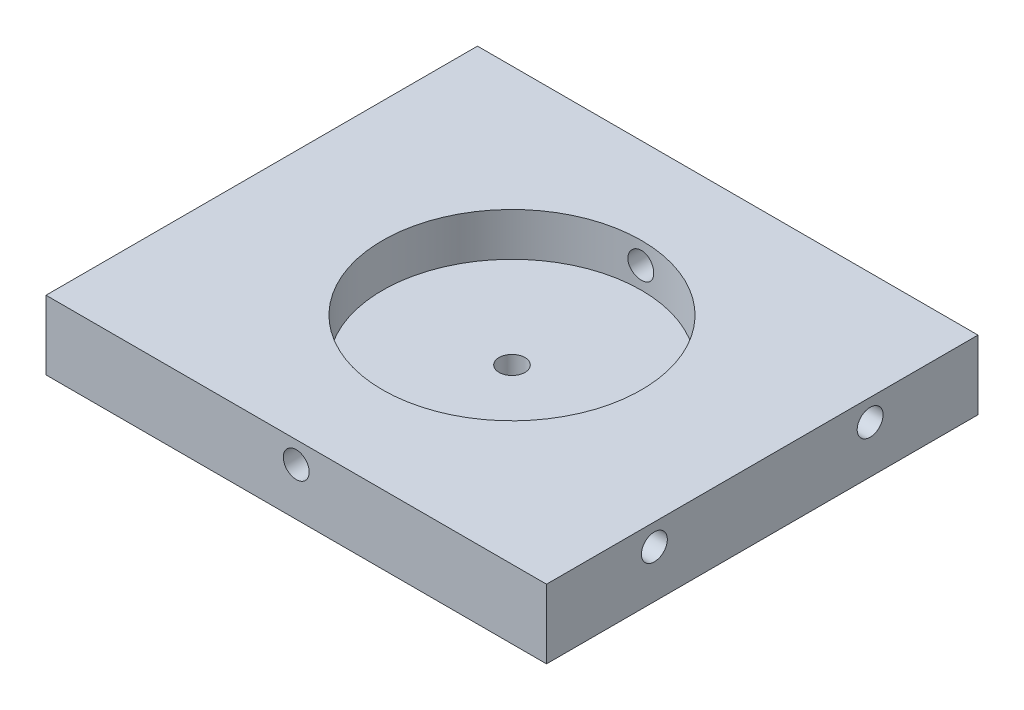
ISO-10303-21;
HEADER;
FILE_DESCRIPTION(('STEP AP214'),'2;1');
FILE_NAME('part.step','',(''),(''),'','','');
FILE_SCHEMA(('AUTOMOTIVE_DESIGN { 1 0 10303 214 1 1 1 1 }'));
ENDSEC;
DATA;
#1=APPLICATION_CONTEXT('core data for automotive mechanical design processes');
#2=APPLICATION_PROTOCOL_DEFINITION('international standard','automotive_design',2000,#1);
#3=PRODUCT_CONTEXT('',#1,'mechanical');
#4=PRODUCT('Part','Part','',(#3));
#5=PRODUCT_RELATED_PRODUCT_CATEGORY('part','',(#4));
#6=PRODUCT_DEFINITION_FORMATION('','',#4);
#7=PRODUCT_DEFINITION_CONTEXT('part definition',#1,'design');
#8=PRODUCT_DEFINITION('design','',#6,#7);
#9=PRODUCT_DEFINITION_SHAPE('','',#8);
#10=(LENGTH_UNIT() NAMED_UNIT(*) SI_UNIT(.MILLI.,.METRE.));
#11=(NAMED_UNIT(*) PLANE_ANGLE_UNIT() SI_UNIT($,.RADIAN.));
#12=(NAMED_UNIT(*) SI_UNIT($,.STERADIAN.) SOLID_ANGLE_UNIT());
#13=UNCERTAINTY_MEASURE_WITH_UNIT(LENGTH_MEASURE(1.E-05),#10,'distance_accuracy_value','');
#14=(GEOMETRIC_REPRESENTATION_CONTEXT(3) GLOBAL_UNCERTAINTY_ASSIGNED_CONTEXT((#13)) GLOBAL_UNIT_ASSIGNED_CONTEXT((#10,
#11,#12)) REPRESENTATION_CONTEXT('',''));
#15=CARTESIAN_POINT('',(0.,0.,0.));
#16=DIRECTION('',(0.,0.,1.));
#17=DIRECTION('',(1.,0.,0.));
#18=AXIS2_PLACEMENT_3D('',#15,#16,#17);
#19=CARTESIAN_POINT('',(-5.5,-45.,50.));
#20=DIRECTION('',(1.,0.,0.));
#21=DIRECTION('',(0.,1.,0.));
#22=AXIS2_PLACEMENT_3D('',#19,#20,#21);
#23=PLANE('',#22);
#24=CARTESIAN_POINT('',(-5.50000000000004,-47.5,12.5));
#25=DIRECTION('',(-1.,0.,0.));
#26=DIRECTION('',(0.,0.,1.));
#27=AXIS2_PLACEMENT_3D('',#24,#25,#26);
#28=CIRCLE('',#27,1.5);
#29=CARTESIAN_POINT('',(-5.50000000000004,-47.5,14.));
#30=VERTEX_POINT('',#29);
#31=EDGE_CURVE('E203',#30,#30,#28,.T.);
#32=ORIENTED_EDGE('',*,*,#31,.F.);
#33=EDGE_LOOP('',(#32));
#34=FACE_BOUND('',#33,.T.);
#35=CARTESIAN_POINT('',(-5.50000000000004,-47.5,37.5));
#36=DIRECTION('',(-1.,0.,0.));
#37=DIRECTION('',(0.,0.,1.));
#38=AXIS2_PLACEMENT_3D('',#35,#36,#37);
#39=CIRCLE('',#38,1.5);
#40=CARTESIAN_POINT('',(-5.50000000000004,-47.5,39.));
#41=VERTEX_POINT('',#40);
#42=EDGE_CURVE('E206',#41,#41,#39,.T.);
#43=ORIENTED_EDGE('',*,*,#42,.F.);
#44=EDGE_LOOP('',(#43));
#45=FACE_BOUND('',#44,.T.);
#46=DIRECTION('',(0.,-1.,0.));
#47=VECTOR('',#46,1.);
#48=CARTESIAN_POINT('',(-5.5,-45.,0.));
#49=LINE('',#48,#47);
#50=CARTESIAN_POINT('',(-5.5,-45.,0.));
#51=VERTEX_POINT('',#50);
#52=CARTESIAN_POINT('',(-5.5,-53.,0.));
#53=VERTEX_POINT('',#52);
#54=EDGE_CURVE('E115',#51,#53,#49,.T.);
#55=ORIENTED_EDGE('',*,*,#54,.T.);
#56=DIRECTION('',(0.,0.,-1.));
#57=VECTOR('',#56,1.);
#58=CARTESIAN_POINT('',(-5.5,-53.,50.));
#59=LINE('',#58,#57);
#60=CARTESIAN_POINT('',(-5.5,-53.,50.));
#61=VERTEX_POINT('',#60);
#62=EDGE_CURVE('E11',#61,#53,#59,.T.);
#63=ORIENTED_EDGE('',*,*,#62,.F.);
#64=DIRECTION('',(0.,-1.,0.));
#65=VECTOR('',#64,1.);
#66=CARTESIAN_POINT('',(-5.5,-45.,50.));
#67=LINE('',#66,#65);
#68=CARTESIAN_POINT('',(-5.5,-45.,50.));
#69=VERTEX_POINT('',#68);
#70=EDGE_CURVE('E96',#69,#61,#67,.T.);
#71=ORIENTED_EDGE('',*,*,#70,.F.);
#72=DIRECTION('',(0.,0.,-1.));
#73=VECTOR('',#72,1.);
#74=CARTESIAN_POINT('',(-5.5,-45.,50.));
#75=LINE('',#74,#73);
#76=EDGE_CURVE('E63',#69,#51,#75,.T.);
#77=ORIENTED_EDGE('',*,*,#76,.T.);
#78=EDGE_LOOP('',(#55,#63,#71,#77));
#79=FACE_BOUND('',#78,.T.);
#80=ADVANCED_FACE('F39',(#34,#45,#79),#23,.F.);
#81=CARTESIAN_POINT('',(-5.5,-53.,50.));
#82=DIRECTION('',(0.,1.,0.));
#83=DIRECTION('',(0.,0.,1.));
#84=AXIS2_PLACEMENT_3D('',#81,#82,#83);
#85=PLANE('',#84);
#86=CARTESIAN_POINT('',(23.5,-53.,25.));
#87=DIRECTION('',(0.,1.,0.));
#88=DIRECTION('',(0.,0.,1.));
#89=AXIS2_PLACEMENT_3D('',#86,#87,#88);
#90=CIRCLE('',#89,1.5);
#91=CARTESIAN_POINT('',(23.5,-53.,26.5));
#92=VERTEX_POINT('',#91);
#93=EDGE_CURVE('E235',#92,#92,#90,.T.);
#94=ORIENTED_EDGE('',*,*,#93,.T.);
#95=EDGE_LOOP('',(#94));
#96=FACE_BOUND('',#95,.T.);
#97=DIRECTION('',(1.,0.,0.));
#98=VECTOR('',#97,1.);
#99=CARTESIAN_POINT('',(-5.5,-53.,0.));
#100=LINE('',#99,#98);
#101=CARTESIAN_POINT('',(52.5,-53.,0.));
#102=VERTEX_POINT('',#101);
#103=EDGE_CURVE('E102',#53,#102,#100,.T.);
#104=ORIENTED_EDGE('',*,*,#103,.T.);
#105=DIRECTION('',(0.,0.,-1.));
#106=VECTOR('',#105,1.);
#107=CARTESIAN_POINT('',(52.5,-53.,50.));
#108=LINE('',#107,#106);
#109=CARTESIAN_POINT('',(52.5,-53.,50.));
#110=VERTEX_POINT('',#109);
#111=EDGE_CURVE('E54',#110,#102,#108,.T.);
#112=ORIENTED_EDGE('',*,*,#111,.F.);
#113=DIRECTION('',(1.,0.,0.));
#114=VECTOR('',#113,1.);
#115=CARTESIAN_POINT('',(-5.5,-53.,50.));
#116=LINE('',#115,#114);
#117=EDGE_CURVE('E88',#61,#110,#116,.T.);
#118=ORIENTED_EDGE('',*,*,#117,.F.);
#119=ORIENTED_EDGE('',*,*,#62,.T.);
#120=EDGE_LOOP('',(#104,#112,#118,#119));
#121=FACE_BOUND('',#120,.T.);
#122=ADVANCED_FACE('F101',(#96,#121),#85,.F.);
#123=CARTESIAN_POINT('',(52.5,-45.,50.));
#124=DIRECTION('',(1.,0.,0.));
#125=DIRECTION('',(0.,0.,-1.));
#126=AXIS2_PLACEMENT_3D('',#123,#124,#125);
#127=PLANE('',#126);
#128=CARTESIAN_POINT('',(52.5,-47.5,37.5));
#129=DIRECTION('',(1.,0.,0.));
#130=DIRECTION('',(0.,0.,-1.));
#131=AXIS2_PLACEMENT_3D('',#128,#129,#130);
#132=CIRCLE('',#131,1.5);
#133=CARTESIAN_POINT('',(52.5,-47.5,36.));
#134=VERTEX_POINT('',#133);
#135=EDGE_CURVE('E248',#134,#134,#132,.T.);
#136=ORIENTED_EDGE('',*,*,#135,.F.);
#137=EDGE_LOOP('',(#136));
#138=FACE_BOUND('',#137,.T.);
#139=CARTESIAN_POINT('',(52.5,-47.5,12.5));
#140=DIRECTION('',(1.,0.,0.));
#141=DIRECTION('',(0.,0.,-1.));
#142=AXIS2_PLACEMENT_3D('',#139,#140,#141);
#143=CIRCLE('',#142,1.5);
#144=CARTESIAN_POINT('',(52.5,-47.5,11.));
#145=VERTEX_POINT('',#144);
#146=EDGE_CURVE('E239',#145,#145,#143,.T.);
#147=ORIENTED_EDGE('',*,*,#146,.F.);
#148=EDGE_LOOP('',(#147));
#149=FACE_BOUND('',#148,.T.);
#150=DIRECTION('',(0.,-1.,0.));
#151=VECTOR('',#150,1.);
#152=CARTESIAN_POINT('',(52.5,-45.,0.));
#153=LINE('',#152,#151);
#154=CARTESIAN_POINT('',(52.5,-45.,0.));
#155=VERTEX_POINT('',#154);
#156=EDGE_CURVE('E121',#155,#102,#153,.T.);
#157=ORIENTED_EDGE('',*,*,#156,.F.);
#158=DIRECTION('',(0.,0.,-1.));
#159=VECTOR('',#158,1.);
#160=CARTESIAN_POINT('',(52.5,-45.,50.));
#161=LINE('',#160,#159);
#162=CARTESIAN_POINT('',(52.5,-45.,50.));
#163=VERTEX_POINT('',#162);
#164=EDGE_CURVE('E77',#163,#155,#161,.T.);
#165=ORIENTED_EDGE('',*,*,#164,.F.);
#166=DIRECTION('',(0.,-1.,0.));
#167=VECTOR('',#166,1.);
#168=CARTESIAN_POINT('',(52.5,-45.,50.));
#169=LINE('',#168,#167);
#170=EDGE_CURVE('E95',#163,#110,#169,.T.);
#171=ORIENTED_EDGE('',*,*,#170,.T.);
#172=ORIENTED_EDGE('',*,*,#111,.T.);
#173=EDGE_LOOP('',(#157,#165,#171,#172));
#174=FACE_BOUND('',#173,.T.);
#175=ADVANCED_FACE('F107',(#138,#149,#174),#127,.T.);
#176=CARTESIAN_POINT('',(-5.5,-45.,50.));
#177=DIRECTION('',(0.,1.,0.));
#178=DIRECTION('',(0.,0.,1.));
#179=AXIS2_PLACEMENT_3D('',#176,#177,#178);
#180=PLANE('',#179);
#181=CARTESIAN_POINT('',(23.5,-45.,25.));
#182=DIRECTION('',(0.,1.,0.));
#183=DIRECTION('',(0.,0.,1.));
#184=AXIS2_PLACEMENT_3D('',#181,#182,#183);
#185=CIRCLE('',#184,15.);
#186=CARTESIAN_POINT('',(23.5,-45.,40.));
#187=VERTEX_POINT('',#186);
#188=EDGE_CURVE('E263',#187,#187,#185,.T.);
#189=ORIENTED_EDGE('',*,*,#188,.F.);
#190=EDGE_LOOP('',(#189));
#191=FACE_BOUND('',#190,.T.);
#192=DIRECTION('',(1.,0.,0.));
#193=VECTOR('',#192,1.);
#194=CARTESIAN_POINT('',(-5.5,-45.,0.));
#195=LINE('',#194,#193);
#196=EDGE_CURVE('E124',#51,#155,#195,.T.);
#197=ORIENTED_EDGE('',*,*,#196,.F.);
#198=ORIENTED_EDGE('',*,*,#76,.F.);
#199=DIRECTION('',(1.,0.,0.));
#200=VECTOR('',#199,1.);
#201=CARTESIAN_POINT('',(-5.5,-45.,50.));
#202=LINE('',#201,#200);
#203=EDGE_CURVE('E109',#69,#163,#202,.T.);
#204=ORIENTED_EDGE('',*,*,#203,.T.);
#205=ORIENTED_EDGE('',*,*,#164,.T.);
#206=EDGE_LOOP('',(#197,#198,#204,#205));
#207=FACE_BOUND('',#206,.T.);
#208=ADVANCED_FACE('F208',(#191,#207),#180,.T.);
#209=CARTESIAN_POINT('',(0.,0.,50.));
#210=DIRECTION('',(0.,0.,1.));
#211=DIRECTION('',(1.,0.,0.));
#212=AXIS2_PLACEMENT_3D('',#209,#210,#211);
#213=PLANE('',#212);
#214=CARTESIAN_POINT('',(23.5,-47.5,50.));
#215=DIRECTION('',(0.,0.,-1.));
#216=DIRECTION('',(-1.,0.,0.));
#217=AXIS2_PLACEMENT_3D('',#214,#215,#216);
#218=CIRCLE('',#217,1.5);
#219=CARTESIAN_POINT('',(22.,-47.5,50.));
#220=VERTEX_POINT('',#219);
#221=EDGE_CURVE('E137',#220,#220,#218,.T.);
#222=ORIENTED_EDGE('',*,*,#221,.T.);
#223=EDGE_LOOP('',(#222));
#224=FACE_BOUND('',#223,.T.);
#225=ORIENTED_EDGE('',*,*,#70,.T.);
#226=ORIENTED_EDGE('',*,*,#117,.T.);
#227=ORIENTED_EDGE('',*,*,#170,.F.);
#228=ORIENTED_EDGE('',*,*,#203,.F.);
#229=EDGE_LOOP('',(#225,#226,#227,#228));
#230=FACE_BOUND('',#229,.T.);
#231=ADVANCED_FACE('F92',(#224,#230),#213,.T.);
#232=CARTESIAN_POINT('',(0.,0.,0.));
#233=DIRECTION('',(0.,0.,1.));
#234=DIRECTION('',(1.,0.,0.));
#235=AXIS2_PLACEMENT_3D('',#232,#233,#234);
#236=PLANE('',#235);
#237=CARTESIAN_POINT('',(23.5,-47.5,0.));
#238=DIRECTION('',(0.,0.,-1.));
#239=DIRECTION('',(-1.,0.,0.));
#240=AXIS2_PLACEMENT_3D('',#237,#238,#239);
#241=CIRCLE('',#240,1.5);
#242=CARTESIAN_POINT('',(22.,-47.5,0.));
#243=VERTEX_POINT('',#242);
#244=EDGE_CURVE('E227',#243,#243,#241,.T.);
#245=ORIENTED_EDGE('',*,*,#244,.F.);
#246=EDGE_LOOP('',(#245));
#247=FACE_BOUND('',#246,.T.);
#248=ORIENTED_EDGE('',*,*,#54,.F.);
#249=ORIENTED_EDGE('',*,*,#196,.T.);
#250=ORIENTED_EDGE('',*,*,#156,.T.);
#251=ORIENTED_EDGE('',*,*,#103,.F.);
#252=EDGE_LOOP('',(#248,#249,#250,#251));
#253=FACE_BOUND('',#252,.T.);
#254=ADVANCED_FACE('F190',(#247,#253),#236,.F.);
#255=CARTESIAN_POINT('',(23.5,-50.,25.));
#256=DIRECTION('',(0.,1.,0.));
#257=DIRECTION('',(0.,0.,1.));
#258=AXIS2_PLACEMENT_3D('',#255,#256,#257);
#259=CYLINDRICAL_SURFACE('',#258,15.);
#260=CARTESIAN_POINT('',(23.5,-49.,40.));
#261=CARTESIAN_POINT('',(23.5840305306873,-48.9999963611494,39.9999990328115));
#262=CARTESIAN_POINT('',(23.6681166177517,-48.9929150966553,39.9992863839431));
#263=CARTESIAN_POINT('',(23.8339575977453,-48.9647734445644,39.9965120139211));
#264=CARTESIAN_POINT('',(23.9157098187532,-48.9436976559631,39.9944488065104));
#265=CARTESIAN_POINT('',(24.0744575131801,-48.8881866391033,39.9892062184461));
#266=CARTESIAN_POINT('',(24.1514558269224,-48.8537594792223,39.9860275120106));
#267=CARTESIAN_POINT('',(24.2985642414406,-48.7725386381025,39.9789093609146));
#268=CARTESIAN_POINT('',(24.3686757081686,-48.7257474159998,39.974970067572));
#269=CARTESIAN_POINT('',(24.5002893260111,-48.6209459535066,39.9667561651199));
#270=CARTESIAN_POINT('',(24.5617632172523,-48.562900300897,39.962480523608));
#271=CARTESIAN_POINT('',(24.6741137821465,-48.4373131986055,39.9540843535939));
#272=CARTESIAN_POINT('',(24.724989965624,-48.3697713099364,39.9499638322737));
#273=CARTESIAN_POINT('',(24.8148009556654,-48.2269322024746,39.9423338732918));
#274=CARTESIAN_POINT('',(24.8537101981823,-48.1516188338577,39.9388257506636));
#275=CARTESIAN_POINT('',(24.9183195771141,-47.9954866211426,39.9328305631979));
#276=CARTESIAN_POINT('',(24.9440200398869,-47.9146679131241,39.9303434731333));
#277=CARTESIAN_POINT('',(24.9813985624028,-47.750107298701,39.9266812610947));
#278=CARTESIAN_POINT('',(24.9931234795057,-47.6663761347217,39.9255017559714));
#279=CARTESIAN_POINT('',(25.0023629277031,-47.4981267049063,39.9245746459079));
#280=CARTESIAN_POINT('',(24.9998778323062,-47.4136084598169,39.9248270033312));
#281=CARTESIAN_POINT('',(24.980806420379,-47.24650703546,39.926731103484));
#282=CARTESIAN_POINT('',(24.9642712661868,-47.163917951007,39.9283777688598));
#283=CARTESIAN_POINT('',(24.9176487162259,-47.0026930551984,39.9328770143113));
#284=CARTESIAN_POINT('',(24.8875611373836,-46.9240572972625,39.9357296106774));
#285=CARTESIAN_POINT('',(24.8146313408223,-46.7728096190517,39.9423251417811));
#286=CARTESIAN_POINT('',(24.77176642408,-46.700208715766,39.9460696586224));
#287=CARTESIAN_POINT('',(24.6745150410298,-46.5632121776322,39.9540257759932));
#288=CARTESIAN_POINT('',(24.6201282375048,-46.4988167830274,39.9582373901918));
#289=CARTESIAN_POINT('',(24.5010911686181,-46.3797619090165,39.9666757796948));
#290=CARTESIAN_POINT('',(24.4363967182771,-46.3251465971788,39.970902539995));
#291=CARTESIAN_POINT('',(24.2987342226057,-46.2275445506344,39.9788774361778));
#292=CARTESIAN_POINT('',(24.2257661679994,-46.1845578289653,39.9826255715238));
#293=CARTESIAN_POINT('',(24.0735971585386,-46.1114349695346,39.9892221350064));
#294=CARTESIAN_POINT('',(23.9943951195849,-46.0813010727729,39.9920704062215));
#295=CARTESIAN_POINT('',(23.8320208259949,-46.0347716249324,39.9965447116211));
#296=CARTESIAN_POINT('',(23.7488486901649,-46.0183756630141,39.9981707823559));
#297=CARTESIAN_POINT('',(23.5812776486379,-45.9998435383979,40.0000127750247));
#298=CARTESIAN_POINT('',(23.4968855468418,-45.9976464276213,40.000234724016));
#299=CARTESIAN_POINT('',(23.3289343100265,-46.0074142945731,39.999259626352));
#300=CARTESIAN_POINT('',(23.2453751637693,-46.0193790809729,39.998062598867));
#301=CARTESIAN_POINT('',(23.081637689748,-46.0570805431324,39.9943879230879));
#302=CARTESIAN_POINT('',(23.001452726542,-46.082788681717,39.9919129287706));
#303=CARTESIAN_POINT('',(22.8465335179243,-46.1472177610559,39.9859599829091));
#304=CARTESIAN_POINT('',(22.7717993947643,-46.1859389935591,39.9824820088788));
#305=CARTESIAN_POINT('',(22.6296277297418,-46.2754462579959,39.9748971299563));
#306=CARTESIAN_POINT('',(22.5622155103766,-46.3262723333887,39.9707881540516));
#307=CARTESIAN_POINT('',(22.4368575650322,-46.4384891016114,39.9624089930428));
#308=CARTESIAN_POINT('',(22.3789120767262,-46.4998800596055,39.9581388038946));
#309=CARTESIAN_POINT('',(22.2739208351693,-46.6317498619885,39.9499003621113));
#310=CARTESIAN_POINT('',(22.2269150819807,-46.7022606348139,39.9459332520846));
#311=CARTESIAN_POINT('',(22.1454126118843,-46.85021104022,39.9387674869133));
#312=CARTESIAN_POINT('',(22.1109157239192,-46.9276505780326,39.9355688212606));
#313=CARTESIAN_POINT('',(22.0554771869733,-47.0871231091987,39.9303092145107));
#314=CARTESIAN_POINT('',(22.0345117377822,-47.1691477601367,39.9282462767468));
#315=CARTESIAN_POINT('',(22.0066539893058,-47.3355747969412,39.9254854792432));
#316=CARTESIAN_POINT('',(21.9997612864007,-47.4199771145435,39.9247875803528));
#317=CARTESIAN_POINT('',(22.0002502922931,-47.5883660325351,39.9248366966134));
#318=CARTESIAN_POINT('',(22.0075691656103,-47.6723528243242,39.9255773513051));
#319=CARTESIAN_POINT('',(22.0361418205545,-47.8378973757524,39.9284065583432));
#320=CARTESIAN_POINT('',(22.0573956178568,-47.919455132659,39.9304951122058));
#321=CARTESIAN_POINT('',(22.1132174705537,-48.0778260235718,39.9357830239478));
#322=CARTESIAN_POINT('',(22.1477836834886,-48.1546398124446,39.9389822281054));
#323=CARTESIAN_POINT('',(22.2292426676334,-48.3013853375066,39.9461312775904));
#324=CARTESIAN_POINT('',(22.2761353698169,-48.3713171122309,39.9500811187143));
#325=CARTESIAN_POINT('',(22.381152165572,-48.5026355117079,39.9583073081455));
#326=CARTESIAN_POINT('',(22.4393230766646,-48.5639846145506,39.9625849709013));
#327=CARTESIAN_POINT('',(22.5651524511623,-48.6760783490495,39.9709728209318));
#328=CARTESIAN_POINT('',(22.6328131838376,-48.7268204370358,39.9750829678446));
#329=CARTESIAN_POINT('',(22.7758878487581,-48.8163601807819,39.9826834310374));
#330=CARTESIAN_POINT('',(22.8513208759799,-48.8551274364178,39.9861721604022));
#331=CARTESIAN_POINT('',(23.0076125813492,-48.9193936342358,39.9921194387484));
#332=CARTESIAN_POINT('',(23.0884650252616,-48.9449075364303,39.9945791486448));
#333=CARTESIAN_POINT('',(23.2248126078914,-48.9755809256272,39.997573206606));
#334=CARTESIAN_POINT('',(23.2794361707332,-48.984725566449,39.9984790103775));
#335=CARTESIAN_POINT('',(23.389365128774,-48.9969362890927,39.9996927242618));
#336=CARTESIAN_POINT('',(23.4446705211602,-49.0000023959828,40.0000006368404));
#337=CARTESIAN_POINT('',(23.5,-49.,40.));
#338=B_SPLINE_CURVE_WITH_KNOTS('',3,(#260,#261,#262,#263,#264,#265,#266,#267,#268,#269,#270,
#271,#272,#273,#274,#275,#276,#277,#278,#279,#280,#281,#282,#283,#284,#285,#286,#287,#288,#289,
#290,#291,#292,#293,#294,#295,#296,#297,#298,#299,#300,#301,#302,#303,#304,#305,#306,#307,#308,
#309,#310,#311,#312,#313,#314,#315,#316,#317,#318,#319,#320,#321,#322,#323,#324,#325,#326,#327,
#328,#329,#330,#331,#332,#333,#334,#335,#336,#337),.UNSPECIFIED.,.T.,.F.,(4,2,2,2,2,2,2,2,2,2,2,
2,2,2,2,2,2,2,2,2,2,2,2,2,2,2,2,2,2,2,2,2,2,2,2,2,2,2,4),(0.,0.251889549402713,
0.504056764253229,0.756071828598304,1.00803680637417,1.26080785293442,1.51359058831059,
1.76690963208332,2.02022241663756,2.27268348067795,2.52513790883665,2.77667696161667,
3.02821941242451,3.28021142059342,3.53221080496688,3.78532101294309,4.03843150469658,
4.29158611040372,4.54473314513159,4.79679282911636,5.04884910778715,5.30038402941457,
5.551924590742,5.80430911123047,6.05669996715345,6.30999965412897,6.56329587713061,
6.81614535889505,7.06898758859378,7.32071443940935,7.57244157339059,7.824133880442,
8.0758247780844,8.3285837614148,8.58140328955437,8.83485946539363,9.08802892192942,
9.25388500848523,9.41974041103541),.UNSPECIFIED.);
#339=CARTESIAN_POINT('',(23.5,-49.,40.));
#340=VERTEX_POINT('',#339);
#341=EDGE_CURVE('E42',#340,#340,#338,.T.);
#342=ORIENTED_EDGE('',*,*,#341,.T.);
#343=EDGE_LOOP('',(#342));
#344=FACE_BOUND('',#343,.T.);
#345=CARTESIAN_POINT('',(22.,-47.5,10.0751884434007));
#346=CARTESIAN_POINT('',(22.0000036399097,-47.4159706537396,10.0751874580465));
#347=CARTESIAN_POINT('',(22.0070847115263,-47.3318857473822,10.0744711450867));
#348=CARTESIAN_POINT('',(22.0352255278547,-47.1660472205597,10.0716836866282));
#349=CARTESIAN_POINT('',(22.0563006776704,-47.0842962729438,10.0696110480817));
#350=CARTESIAN_POINT('',(22.1118098258966,-46.9255512711731,10.0643480042892));
#351=CARTESIAN_POINT('',(22.1462357255592,-46.8485543659128,10.0611582767982));
#352=CARTESIAN_POINT('',(22.2274535989134,-46.7014483115624,10.0540212914227));
#353=CARTESIAN_POINT('',(22.2742431165611,-46.6313377982744,10.0500741840351));
#354=CARTESIAN_POINT('',(22.379042857002,-46.4997231045138,10.0418510993515));
#355=CARTESIAN_POINT('',(22.4370888728376,-46.4382474857443,10.037574099921));
#356=CARTESIAN_POINT('',(22.5626774270207,-46.3258935864947,10.0291824214642));
#357=CARTESIAN_POINT('',(22.6302203996402,-46.2750157908905,10.0250677498718));
#358=CARTESIAN_POINT('',(22.7730604575235,-46.1852031144893,10.0174542526659));
#359=CARTESIAN_POINT('',(22.8483735062057,-46.1462935018095,10.0139567365803));
#360=CARTESIAN_POINT('',(23.0045050235687,-46.081683350277,10.0079827468634));
#361=CARTESIAN_POINT('',(23.0853233579977,-46.0559824894458,10.005506248344));
#362=CARTESIAN_POINT('',(23.2498828258856,-46.0186031359701,10.0018605014346));
#363=CARTESIAN_POINT('',(23.3336132094526,-46.0068777508751,10.0006868823578));
#364=CARTESIAN_POINT('',(23.5018611110334,-45.9976370962994,9.99976426601962));
#365=CARTESIAN_POINT('',(23.5863786085817,-46.0001214583806,10.0000152318209));
#366=CARTESIAN_POINT('',(23.7534832660968,-46.0191917089752,10.0019099303322));
#367=CARTESIAN_POINT('',(23.8360762449025,-46.0357271733458,10.0035486827243));
#368=CARTESIAN_POINT('',(23.9973087692568,-46.0823516934199,10.008029061026));
#369=CARTESIAN_POINT('',(24.0759482634366,-46.1124409251814,10.0108707025607));
#370=CARTESIAN_POINT('',(24.2272004720194,-46.1853741448817,10.0174459377413));
#371=CARTESIAN_POINT('',(24.2998023564725,-46.2282404462952,10.0211810895136));
#372=CARTESIAN_POINT('',(24.4368002697613,-46.3254947850046,10.0291242322089));
#373=CARTESIAN_POINT('',(24.5011960578412,-46.3798831602178,10.0333322369978));
#374=CARTESIAN_POINT('',(24.620249157734,-46.4989213442705,10.0417705979822));
#375=CARTESIAN_POINT('',(24.6748626192855,-46.5636150171124,10.0460009714046));
#376=CARTESIAN_POINT('',(24.7724613030369,-46.7012752978162,10.0539889010767));
#377=CARTESIAN_POINT('',(24.8154465083693,-46.7742419176782,10.0577464566405));
#378=CARTESIAN_POINT('',(24.8885682768599,-46.9264105377997,10.0643636572878));
#379=CARTESIAN_POINT('',(24.9187021308594,-47.0056138486343,10.0672231130117));
#380=CARTESIAN_POINT('',(24.9652311034564,-47.167990906922,10.0717164719359));
#381=CARTESIAN_POINT('',(24.9816266406146,-47.2511645333312,10.0733504124735));
#382=CARTESIAN_POINT('',(25.0001571630879,-47.4187362692943,10.0752012920887));
#383=CARTESIAN_POINT('',(25.0023534949708,-47.5031275303973,10.075424326786));
#384=CARTESIAN_POINT('',(24.992584370307,-47.6710768987343,10.0744442296784));
#385=CARTESIAN_POINT('',(24.9806191051146,-47.7546350172106,10.0732411171441));
#386=CARTESIAN_POINT('',(24.9429177617613,-47.9183673734175,10.069549833664));
#387=CARTESIAN_POINT('',(24.9172106907834,-47.998548356642,10.0670643699798));
#388=CARTESIAN_POINT('',(24.8527850795139,-48.1534600775955,10.0610906344181));
#389=CARTESIAN_POINT('',(24.8140662411754,-48.2281906904308,10.05760233957));
#390=CARTESIAN_POINT('',(24.7245625021348,-48.3703599610432,10.0500012346643));
#391=CARTESIAN_POINT('',(24.673736949761,-48.4377729129494,10.0458863377799));
#392=CARTESIAN_POINT('',(24.5615208001768,-48.5631325799111,10.0375025106222));
#393=CARTESIAN_POINT('',(24.5001299413722,-48.6210790605101,10.033233576537));
#394=CARTESIAN_POINT('',(24.3682597063397,-48.7260724500971,10.0250042822605));
#395=CARTESIAN_POINT('',(24.2977483839542,-48.7730793393793,10.0210450891679));
#396=CARTESIAN_POINT('',(24.1497965761257,-48.8545838027596,10.0138983684005));
#397=CARTESIAN_POINT('',(24.0723561856444,-48.8890815482607,10.0107108301526));
#398=CARTESIAN_POINT('',(23.9128841896492,-48.944520651483,10.0054718437899));
#399=CARTESIAN_POINT('',(23.8308610564749,-48.9654861809878,10.0034183709153));
#400=CARTESIAN_POINT('',(23.6644372209755,-48.9933446043698,10.0006705807953));
#401=CARTESIAN_POINT('',(23.5800365855383,-49.0002378937511,9.99997622535156));
#402=CARTESIAN_POINT('',(23.4116466638864,-48.9997506003401,10.000024925301));
#403=CARTESIAN_POINT('',(23.3276571891632,-48.992432144745,10.00076172435));
#404=CARTESIAN_POINT('',(23.1621071674655,-48.9638593815145,10.0035775963361));
#405=CARTESIAN_POINT('',(23.0805466223975,-48.9426050629406,10.0056566703269));
#406=CARTESIAN_POINT('',(22.9221701368484,-48.8867811139106,10.0109241427906));
#407=CARTESIAN_POINT('',(22.8453535508837,-48.8522132995988,10.0141123899513));
#408=CARTESIAN_POINT('',(22.6986030997678,-48.7707502466245,10.0212428137556));
#409=CARTESIAN_POINT('',(22.6286691943472,-48.7238550800933,10.0251849859877));
#410=CARTESIAN_POINT('',(22.4973509133596,-48.6188355714644,10.0334022299642));
#411=CARTESIAN_POINT('',(22.436003610671,-48.5606649756328,10.0376786280895));
#412=CARTESIAN_POINT('',(22.3239133609103,-48.4348369726818,10.0460711384551));
#413=CARTESIAN_POINT('',(22.2731729622282,-48.3671772922464,10.0501872119833));
#414=CARTESIAN_POINT('',(22.1836350393639,-48.2241034871201,10.057804248841));
#415=CARTESIAN_POINT('',(22.1448682180078,-48.1486700780139,10.0613036211204));
#416=CARTESIAN_POINT('',(22.0806029378519,-47.9923775631307,10.0672720785631));
#417=CARTESIAN_POINT('',(22.0550895131652,-47.9115246941114,10.0697423251996));
#418=CARTESIAN_POINT('',(22.0244174674997,-47.7751783886513,10.0727498869278));
#419=CARTESIAN_POINT('',(22.0152734314027,-47.7205566230404,10.0736600209646));
#420=CARTESIAN_POINT('',(22.0030635120923,-47.6106312654362,10.0748796223351));
#421=CARTESIAN_POINT('',(21.9999976033641,-47.5553276763061,10.0751890921902));
#422=CARTESIAN_POINT('',(22.,-47.5,10.0751884434007));
#423=B_SPLINE_CURVE_WITH_KNOTS('',3,(#345,#346,#347,#348,#349,#350,#351,#352,#353,#354,#355,
#356,#357,#358,#359,#360,#361,#362,#363,#364,#365,#366,#367,#368,#369,#370,#371,#372,#373,#374,
#375,#376,#377,#378,#379,#380,#381,#382,#383,#384,#385,#386,#387,#388,#389,#390,#391,#392,#393,
#394,#395,#396,#397,#398,#399,#400,#401,#402,#403,#404,#405,#406,#407,#408,#409,#410,#411,#412,
#413,#414,#415,#416,#417,#418,#419,#420,#421,#422),.UNSPECIFIED.,.T.,.F.,(4,2,2,2,2,2,2,2,2,2,2,
2,2,2,2,2,2,2,2,2,2,2,2,2,2,2,2,2,2,2,2,2,2,2,2,2,2,2,4),(0.,0.251885991654698,
0.504049727732654,0.756060736496216,1.00802172063198,1.26079742294888,1.51358468782879,
1.76690204956938,2.02021323611692,2.27267206347675,2.52512434497349,2.77667447727993,
3.02822787721462,3.28022318199621,3.53222587827793,3.78533137627502,4.03843724141344,
4.29159643676901,4.5447479189255,4.79680494461649,5.04885856450306,5.30038222056791,
5.55191163841571,5.80429784717577,6.05669030584804,6.30999205227177,6.56329032777008,
6.81613489041542,7.06897234669724,7.32070700202725,7.57244185494987,7.82414237992869,
8.07584143216198,8.32859572556983,8.58141067551788,8.83486861605715,9.08803972341001,
9.2538904140907,9.41974040855723),.UNSPECIFIED.);
#424=CARTESIAN_POINT('',(22.,-47.5,10.0751884434007));
#425=VERTEX_POINT('',#424);
#426=EDGE_CURVE('E131',#425,#425,#423,.T.);
#427=ORIENTED_EDGE('',*,*,#426,.T.);
#428=EDGE_LOOP('',(#427));
#429=FACE_BOUND('',#428,.T.);
#430=CARTESIAN_POINT('',(23.5,-50.,25.));
#431=DIRECTION('',(0.,1.,0.));
#432=DIRECTION('',(0.,0.,1.));
#433=AXIS2_PLACEMENT_3D('',#430,#431,#432);
#434=CIRCLE('',#433,15.);
#435=CARTESIAN_POINT('',(23.5,-50.,40.));
#436=VERTEX_POINT('',#435);
#437=EDGE_CURVE('E118',#436,#436,#434,.T.);
#438=ORIENTED_EDGE('',*,*,#437,.F.);
#439=EDGE_LOOP('',(#438));
#440=FACE_BOUND('',#439,.T.);
#441=ORIENTED_EDGE('',*,*,#188,.T.);
#442=EDGE_LOOP('',(#441));
#443=FACE_BOUND('',#442,.T.);
#444=ADVANCED_FACE('F138',(#344,#429,#440,#443),#259,.F.);
#445=CARTESIAN_POINT('',(23.5,-50.,25.));
#446=DIRECTION('',(0.,1.,0.));
#447=DIRECTION('',(0.,0.,1.));
#448=AXIS2_PLACEMENT_3D('',#445,#446,#447);
#449=PLANE('',#448);
#450=CARTESIAN_POINT('',(23.5,-50.,25.));
#451=DIRECTION('',(0.,1.,0.));
#452=DIRECTION('',(0.,0.,1.));
#453=AXIS2_PLACEMENT_3D('',#450,#451,#452);
#454=CIRCLE('',#453,1.5);
#455=CARTESIAN_POINT('',(23.5,-50.,26.5));
#456=VERTEX_POINT('',#455);
#457=EDGE_CURVE('E240',#456,#456,#454,.T.);
#458=ORIENTED_EDGE('',*,*,#457,.F.);
#459=EDGE_LOOP('',(#458));
#460=FACE_BOUND('',#459,.T.);
#461=ORIENTED_EDGE('',*,*,#437,.T.);
#462=EDGE_LOOP('',(#461));
#463=FACE_BOUND('',#462,.T.);
#464=ADVANCED_FACE('F183',(#460,#463),#449,.T.);
#465=CARTESIAN_POINT('',(4.49999999999996,-47.5,37.5));
#466=DIRECTION('',(-1.,0.,0.));
#467=DIRECTION('',(0.,0.,1.));
#468=AXIS2_PLACEMENT_3D('',#465,#466,#467);
#469=CYLINDRICAL_SURFACE('',#468,1.5);
#470=CARTESIAN_POINT('',(4.49999999999996,-47.5,37.5));
#471=DIRECTION('',(-1.,0.,0.));
#472=DIRECTION('',(0.,0.,1.));
#473=AXIS2_PLACEMENT_3D('',#470,#471,#472);
#474=CIRCLE('',#473,1.5);
#475=CARTESIAN_POINT('',(4.49999999999996,-47.5,39.));
#476=VERTEX_POINT('',#475);
#477=EDGE_CURVE('E266',#476,#476,#474,.T.);
#478=ORIENTED_EDGE('',*,*,#477,.F.);
#479=EDGE_LOOP('',(#478));
#480=FACE_BOUND('',#479,.T.);
#481=ORIENTED_EDGE('',*,*,#42,.T.);
#482=EDGE_LOOP('',(#481));
#483=FACE_BOUND('',#482,.T.);
#484=ADVANCED_FACE('F180',(#480,#483),#469,.F.);
#485=CARTESIAN_POINT('',(4.49999999999996,-47.5,37.5));
#486=DIRECTION('',(-1.,0.,0.));
#487=DIRECTION('',(0.,0.,1.));
#488=AXIS2_PLACEMENT_3D('',#485,#486,#487);
#489=PLANE('',#488);
#490=ORIENTED_EDGE('',*,*,#477,.T.);
#491=EDGE_LOOP('',(#490));
#492=FACE_BOUND('',#491,.T.);
#493=ADVANCED_FACE('F176',(#492),#489,.T.);
#494=CARTESIAN_POINT('',(4.49999999999996,-47.5,12.5));
#495=DIRECTION('',(-1.,0.,0.));
#496=DIRECTION('',(0.,0.,1.));
#497=AXIS2_PLACEMENT_3D('',#494,#495,#496);
#498=CYLINDRICAL_SURFACE('',#497,1.5);
#499=CARTESIAN_POINT('',(4.49999999999996,-47.5,12.5));
#500=DIRECTION('',(-1.,0.,0.));
#501=DIRECTION('',(0.,0.,1.));
#502=AXIS2_PLACEMENT_3D('',#499,#500,#501);
#503=CIRCLE('',#502,1.5);
#504=CARTESIAN_POINT('',(4.49999999999996,-47.5,14.));
#505=VERTEX_POINT('',#504);
#506=EDGE_CURVE('E259',#505,#505,#503,.T.);
#507=ORIENTED_EDGE('',*,*,#506,.F.);
#508=EDGE_LOOP('',(#507));
#509=FACE_BOUND('',#508,.T.);
#510=ORIENTED_EDGE('',*,*,#31,.T.);
#511=EDGE_LOOP('',(#510));
#512=FACE_BOUND('',#511,.T.);
#513=ADVANCED_FACE('F172',(#509,#512),#498,.F.);
#514=CARTESIAN_POINT('',(4.49999999999996,-47.5,12.5));
#515=DIRECTION('',(-1.,0.,0.));
#516=DIRECTION('',(0.,0.,1.));
#517=AXIS2_PLACEMENT_3D('',#514,#515,#516);
#518=PLANE('',#517);
#519=ORIENTED_EDGE('',*,*,#506,.T.);
#520=EDGE_LOOP('',(#519));
#521=FACE_BOUND('',#520,.T.);
#522=ADVANCED_FACE('F168',(#521),#518,.T.);
#523=CARTESIAN_POINT('',(42.5,-47.5,12.5));
#524=DIRECTION('',(1.,0.,0.));
#525=DIRECTION('',(0.,0.,-1.));
#526=AXIS2_PLACEMENT_3D('',#523,#524,#525);
#527=CYLINDRICAL_SURFACE('',#526,1.5);
#528=CARTESIAN_POINT('',(42.5,-47.5,12.5));
#529=DIRECTION('',(1.,0.,0.));
#530=DIRECTION('',(0.,0.,-1.));
#531=AXIS2_PLACEMENT_3D('',#528,#529,#530);
#532=CIRCLE('',#531,1.5);
#533=CARTESIAN_POINT('',(42.5,-47.5,11.));
#534=VERTEX_POINT('',#533);
#535=EDGE_CURVE('E252',#534,#534,#532,.T.);
#536=ORIENTED_EDGE('',*,*,#535,.F.);
#537=EDGE_LOOP('',(#536));
#538=FACE_BOUND('',#537,.T.);
#539=ORIENTED_EDGE('',*,*,#146,.T.);
#540=EDGE_LOOP('',(#539));
#541=FACE_BOUND('',#540,.T.);
#542=ADVANCED_FACE('F164',(#538,#541),#527,.F.);
#543=CARTESIAN_POINT('',(42.5,-47.5,12.5));
#544=DIRECTION('',(1.,0.,0.));
#545=DIRECTION('',(0.,0.,-1.));
#546=AXIS2_PLACEMENT_3D('',#543,#544,#545);
#547=PLANE('',#546);
#548=ORIENTED_EDGE('',*,*,#535,.T.);
#549=EDGE_LOOP('',(#548));
#550=FACE_BOUND('',#549,.T.);
#551=ADVANCED_FACE('F160',(#550),#547,.T.);
#552=CARTESIAN_POINT('',(42.5,-47.5,37.5));
#553=DIRECTION('',(1.,0.,0.));
#554=DIRECTION('',(0.,0.,-1.));
#555=AXIS2_PLACEMENT_3D('',#552,#553,#554);
#556=CYLINDRICAL_SURFACE('',#555,1.5);
#557=CARTESIAN_POINT('',(42.5,-47.5,37.5));
#558=DIRECTION('',(1.,0.,0.));
#559=DIRECTION('',(0.,0.,-1.));
#560=AXIS2_PLACEMENT_3D('',#557,#558,#559);
#561=CIRCLE('',#560,1.5);
#562=CARTESIAN_POINT('',(42.5,-47.5,36.));
#563=VERTEX_POINT('',#562);
#564=EDGE_CURVE('E244',#563,#563,#561,.T.);
#565=ORIENTED_EDGE('',*,*,#564,.F.);
#566=EDGE_LOOP('',(#565));
#567=FACE_BOUND('',#566,.T.);
#568=ORIENTED_EDGE('',*,*,#135,.T.);
#569=EDGE_LOOP('',(#568));
#570=FACE_BOUND('',#569,.T.);
#571=ADVANCED_FACE('F156',(#567,#570),#556,.F.);
#572=CARTESIAN_POINT('',(42.5,-47.5,37.5));
#573=DIRECTION('',(1.,0.,0.));
#574=DIRECTION('',(0.,0.,-1.));
#575=AXIS2_PLACEMENT_3D('',#572,#573,#574);
#576=PLANE('',#575);
#577=ORIENTED_EDGE('',*,*,#564,.T.);
#578=EDGE_LOOP('',(#577));
#579=FACE_BOUND('',#578,.T.);
#580=ADVANCED_FACE('F152',(#579),#576,.T.);
#581=CARTESIAN_POINT('',(23.5,-53.,25.));
#582=DIRECTION('',(0.,1.,0.));
#583=DIRECTION('',(0.,0.,1.));
#584=AXIS2_PLACEMENT_3D('',#581,#582,#583);
#585=CYLINDRICAL_SURFACE('',#584,1.5);
#586=ORIENTED_EDGE('',*,*,#93,.F.);
#587=EDGE_LOOP('',(#586));
#588=FACE_BOUND('',#587,.T.);
#589=ORIENTED_EDGE('',*,*,#457,.T.);
#590=EDGE_LOOP('',(#589));
#591=FACE_BOUND('',#590,.T.);
#592=ADVANCED_FACE('F148',(#588,#591),#585,.F.);
#593=CARTESIAN_POINT('',(23.5,-47.5,50.));
#594=DIRECTION('',(0.,0.,-1.));
#595=DIRECTION('',(-1.,0.,0.));
#596=AXIS2_PLACEMENT_3D('',#593,#594,#595);
#597=CYLINDRICAL_SURFACE('',#596,1.5);
#598=ORIENTED_EDGE('',*,*,#244,.T.);
#599=EDGE_LOOP('',(#598));
#600=FACE_BOUND('',#599,.T.);
#601=ORIENTED_EDGE('',*,*,#426,.F.);
#602=EDGE_LOOP('',(#601));
#603=FACE_BOUND('',#602,.T.);
#604=ADVANCED_FACE('F146',(#600,#603),#597,.F.);
#605=ORIENTED_EDGE('',*,*,#221,.F.);
#606=EDGE_LOOP('',(#605));
#607=FACE_BOUND('',#606,.T.);
#608=ORIENTED_EDGE('',*,*,#341,.F.);
#609=EDGE_LOOP('',(#608));
#610=FACE_BOUND('',#609,.T.);
#611=ADVANCED_FACE('F142',(#607,#610),#597,.F.);
#612=CLOSED_SHELL('',(#80,#122,#175,#208,#231,#254,#444,#464,#484,#493,#513,#522,#542,#551,#571,
#580,#592,#604,#611));
#613=MANIFOLD_SOLID_BREP('B2',#612);
#614=ADVANCED_BREP_SHAPE_REPRESENTATION('',(#18,#613),#14);
#615=SHAPE_DEFINITION_REPRESENTATION(#9,#614);
ENDSEC;
END-ISO-10303-21;
